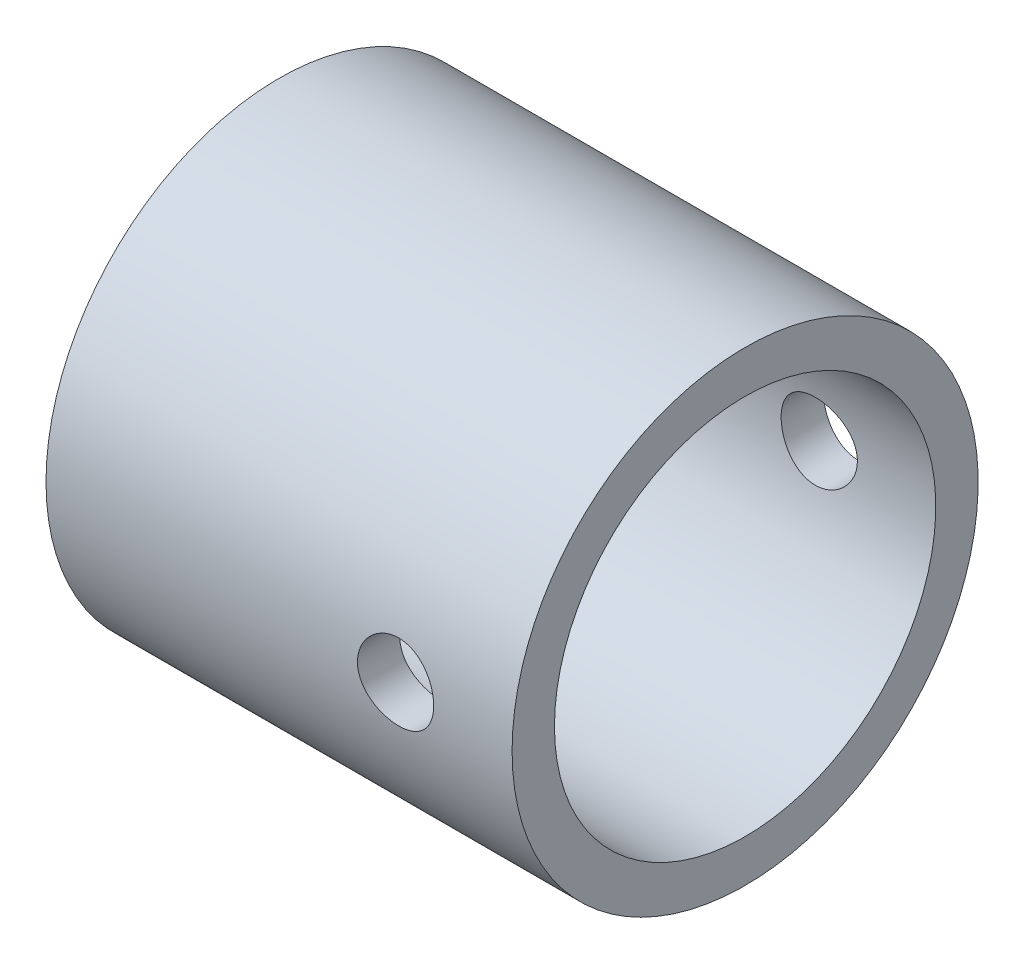
ISO-10303-21;
HEADER;
FILE_DESCRIPTION(('STEP AP214'),'2;1');
FILE_NAME('part.step','',(''),(''),'','','');
FILE_SCHEMA(('AUTOMOTIVE_DESIGN { 1 0 10303 214 1 1 1 1 }'));
ENDSEC;
DATA;
#1=APPLICATION_CONTEXT('core data for automotive mechanical design processes');
#2=APPLICATION_PROTOCOL_DEFINITION('international standard','automotive_design',2000,#1);
#3=PRODUCT_CONTEXT('',#1,'mechanical');
#4=PRODUCT('Part','Part','',(#3));
#5=PRODUCT_RELATED_PRODUCT_CATEGORY('part','',(#4));
#6=PRODUCT_DEFINITION_FORMATION('','',#4);
#7=PRODUCT_DEFINITION_CONTEXT('part definition',#1,'design');
#8=PRODUCT_DEFINITION('design','',#6,#7);
#9=PRODUCT_DEFINITION_SHAPE('','',#8);
#10=(LENGTH_UNIT() NAMED_UNIT(*) SI_UNIT(.MILLI.,.METRE.));
#11=(NAMED_UNIT(*) PLANE_ANGLE_UNIT() SI_UNIT($,.RADIAN.));
#12=(NAMED_UNIT(*) SI_UNIT($,.STERADIAN.) SOLID_ANGLE_UNIT());
#13=UNCERTAINTY_MEASURE_WITH_UNIT(LENGTH_MEASURE(1.E-05),#10,'distance_accuracy_value','');
#14=(GEOMETRIC_REPRESENTATION_CONTEXT(3) GLOBAL_UNCERTAINTY_ASSIGNED_CONTEXT((#13)) GLOBAL_UNIT_ASSIGNED_CONTEXT((#10,
#11,#12)) REPRESENTATION_CONTEXT('',''));
#15=CARTESIAN_POINT('',(0.,0.,0.));
#16=DIRECTION('',(0.,0.,1.));
#17=DIRECTION('',(1.,0.,0.));
#18=AXIS2_PLACEMENT_3D('',#15,#16,#17);
#19=CARTESIAN_POINT('',(261.558388757778,0.,0.));
#20=DIRECTION('',(-1.,0.,0.));
#21=DIRECTION('',(0.,0.,1.));
#22=AXIS2_PLACEMENT_3D('',#19,#20,#21);
#23=PLANE('',#22);
#24=CARTESIAN_POINT('',(261.558388757778,-148.573704322227,0.));
#25=DIRECTION('',(-1.,0.,0.));
#26=DIRECTION('',(0.,0.,1.));
#27=AXIS2_PLACEMENT_3D('',#24,#25,#26);
#28=CIRCLE('',#27,5.50000000000001);
#29=CARTESIAN_POINT('',(261.558388757778,-148.573704322227,5.50000000000001));
#30=VERTEX_POINT('',#29);
#31=EDGE_CURVE('E150',#30,#30,#28,.T.);
#32=ORIENTED_EDGE('',*,*,#31,.T.);
#33=EDGE_LOOP('',(#32));
#34=FACE_BOUND('',#33,.T.);
#35=CARTESIAN_POINT('',(261.558388757778,-148.573704322227,0.));
#36=DIRECTION('',(-1.,0.,0.));
#37=DIRECTION('',(0.,0.,1.));
#38=AXIS2_PLACEMENT_3D('',#35,#36,#37);
#39=CIRCLE('',#38,0.5);
#40=CARTESIAN_POINT('',(261.558388757778,-148.573704322227,0.5));
#41=VERTEX_POINT('',#40);
#42=EDGE_CURVE('E64',#41,#41,#39,.T.);
#43=ORIENTED_EDGE('',*,*,#42,.F.);
#44=EDGE_LOOP('',(#43));
#45=FACE_BOUND('',#44,.T.);
#46=ADVANCED_FACE('F47',(#34,#45),#23,.T.);
#47=CARTESIAN_POINT('',(263.058388757778,-148.573704322227,0.));
#48=DIRECTION('',(-1.,0.,0.));
#49=DIRECTION('',(0.,0.,1.));
#50=AXIS2_PLACEMENT_3D('',#47,#48,#49);
#51=CYLINDRICAL_SURFACE('',#50,0.5);
#52=ORIENTED_EDGE('',*,*,#42,.T.);
#53=EDGE_LOOP('',(#52));
#54=FACE_BOUND('',#53,.T.);
#55=CARTESIAN_POINT('',(263.058388757778,-148.573704322227,0.));
#56=DIRECTION('',(-1.,0.,0.));
#57=DIRECTION('',(0.,0.,1.));
#58=AXIS2_PLACEMENT_3D('',#55,#56,#57);
#59=CIRCLE('',#58,0.5);
#60=CARTESIAN_POINT('',(263.058388757778,-148.573704322227,0.5));
#61=VERTEX_POINT('',#60);
#62=EDGE_CURVE('E69',#61,#61,#59,.T.);
#63=ORIENTED_EDGE('',*,*,#62,.F.);
#64=EDGE_LOOP('',(#63));
#65=FACE_BOUND('',#64,.T.);
#66=ADVANCED_FACE('F116',(#54,#65),#51,.F.);
#67=CARTESIAN_POINT('',(263.058388757778,0.,0.));
#68=DIRECTION('',(-1.,0.,0.));
#69=DIRECTION('',(0.,0.,1.));
#70=AXIS2_PLACEMENT_3D('',#67,#68,#69);
#71=PLANE('',#70);
#72=CARTESIAN_POINT('',(263.058388757778,-148.573704322227,0.));
#73=DIRECTION('',(-1.,0.,0.));
#74=DIRECTION('',(0.,0.,1.));
#75=AXIS2_PLACEMENT_3D('',#72,#73,#74);
#76=CIRCLE('',#75,4.);
#77=CARTESIAN_POINT('',(263.058388757778,-148.573704322227,4.));
#78=VERTEX_POINT('',#77);
#79=EDGE_CURVE('E130',#78,#78,#76,.T.);
#80=ORIENTED_EDGE('',*,*,#79,.F.);
#81=EDGE_LOOP('',(#80));
#82=FACE_BOUND('',#81,.T.);
#83=ORIENTED_EDGE('',*,*,#62,.T.);
#84=EDGE_LOOP('',(#83));
#85=FACE_BOUND('',#84,.T.);
#86=ADVANCED_FACE('F113',(#82,#85),#71,.F.);
#87=CARTESIAN_POINT('',(263.058388757778,-148.573704322227,0.));
#88=DIRECTION('',(-1.,0.,0.));
#89=DIRECTION('',(0.,0.,1.));
#90=AXIS2_PLACEMENT_3D('',#87,#88,#89);
#91=CYLINDRICAL_SURFACE('',#90,4.);
#92=CARTESIAN_POINT('',(262.558388757778,-148.573704322227,0.));
#93=DIRECTION('',(-1.,0.,0.));
#94=DIRECTION('',(0.,0.,1.));
#95=AXIS2_PLACEMENT_3D('',#92,#93,#94);
#96=CIRCLE('',#95,4.);
#97=CARTESIAN_POINT('',(262.558388757778,-148.573704322227,4.));
#98=VERTEX_POINT('',#97);
#99=EDGE_CURVE('E133',#98,#98,#96,.T.);
#100=ORIENTED_EDGE('',*,*,#99,.F.);
#101=EDGE_LOOP('',(#100));
#102=FACE_BOUND('',#101,.T.);
#103=ORIENTED_EDGE('',*,*,#79,.T.);
#104=EDGE_LOOP('',(#103));
#105=FACE_BOUND('',#104,.T.);
#106=ADVANCED_FACE('F109',(#102,#105),#91,.T.);
#107=CARTESIAN_POINT('',(262.558388757778,0.,0.));
#108=DIRECTION('',(-1.,0.,0.));
#109=DIRECTION('',(0.,0.,1.));
#110=AXIS2_PLACEMENT_3D('',#107,#108,#109);
#111=PLANE('',#110);
#112=CARTESIAN_POINT('',(262.558388757778,-148.573704322227,0.));
#113=DIRECTION('',(-1.,0.,0.));
#114=DIRECTION('',(0.,0.,1.));
#115=AXIS2_PLACEMENT_3D('',#112,#113,#114);
#116=CIRCLE('',#115,4.5);
#117=CARTESIAN_POINT('',(262.558388757778,-148.573704322227,4.5));
#118=VERTEX_POINT('',#117);
#119=EDGE_CURVE('E139',#118,#118,#116,.T.);
#120=ORIENTED_EDGE('',*,*,#119,.F.);
#121=EDGE_LOOP('',(#120));
#122=FACE_BOUND('',#121,.T.);
#123=ORIENTED_EDGE('',*,*,#99,.T.);
#124=EDGE_LOOP('',(#123));
#125=FACE_BOUND('',#124,.T.);
#126=ADVANCED_FACE('F104',(#122,#125),#111,.F.);
#127=CARTESIAN_POINT('',(263.058388757778,-148.573704322227,0.));
#128=DIRECTION('',(-1.,0.,0.));
#129=DIRECTION('',(0.,0.,1.));
#130=AXIS2_PLACEMENT_3D('',#127,#128,#129);
#131=CYLINDRICAL_SURFACE('',#130,4.5);
#132=CARTESIAN_POINT('',(270.708388757778,-148.573704322227,4.5));
#133=CARTESIAN_POINT('',(270.708386917729,-148.523685106114,4.49999907822784));
#134=CARTESIAN_POINT('',(270.704204799107,-148.473642628046,4.49915746660408));
#135=CARTESIAN_POINT('',(270.687600107674,-148.374972165307,4.49588129060909));
#136=CARTESIAN_POINT('',(270.675170988256,-148.32634533644,4.49344546074168));
#137=CARTESIAN_POINT('',(270.642471611519,-148.23194704749,4.48725284350458));
#138=CARTESIAN_POINT('',(270.622208864617,-148.186172901087,4.48349732169046));
#139=CARTESIAN_POINT('',(270.574439735018,-148.098677132249,4.47507358231783));
#140=CARTESIAN_POINT('',(270.546933783731,-148.056955268659,4.47040541912137));
#141=CARTESIAN_POINT('',(270.485064112915,-147.978180192644,4.46059948796973));
#142=CARTESIAN_POINT('',(270.450621237926,-147.941189766184,4.45545670953913));
#143=CARTESIAN_POINT('',(270.376025583025,-147.87347124128,4.4453176240733));
#144=CARTESIAN_POINT('',(270.335872357576,-147.842743631934,4.44032132850382));
#145=CARTESIAN_POINT('',(270.250544184067,-147.788155744214,4.43099197631354));
#146=CARTESIAN_POINT('',(270.205326878361,-147.764360477248,4.42666536628451));
#147=CARTESIAN_POINT('',(270.111435120674,-147.724729222305,4.41923641252576));
#148=CARTESIAN_POINT('',(270.062761010766,-147.708892448034,4.41613394785766));
#149=CARTESIAN_POINT('',(269.964012830261,-147.685831552331,4.41155524726984));
#150=CARTESIAN_POINT('',(269.91396546805,-147.678497274064,4.41005823096469));
#151=CARTESIAN_POINT('',(269.81332991855,-147.672307407274,4.40879737554565));
#152=CARTESIAN_POINT('',(269.76274178709,-147.673450951785,4.40903335921057));
#153=CARTESIAN_POINT('',(269.663266648559,-147.684095206435,4.41119296033366));
#154=CARTESIAN_POINT('',(269.614365492713,-147.693469636008,4.41309107572887));
#155=CARTESIAN_POINT('',(269.518844288781,-147.720110226066,4.41832091544001));
#156=CARTESIAN_POINT('',(269.472224349751,-147.737376763436,4.42165270822001));
#157=CARTESIAN_POINT('',(269.382225022244,-147.77943201692,4.42940056650367));
#158=CARTESIAN_POINT('',(269.338869666165,-147.804270786118,4.43382380832334));
#159=CARTESIAN_POINT('',(269.256894992802,-147.860730105112,4.44325156895756));
#160=CARTESIAN_POINT('',(269.218276220612,-147.892351434306,4.4482561545453));
#161=CARTESIAN_POINT('',(269.146142295566,-147.962154381123,4.45839319117316));
#162=CARTESIAN_POINT('',(269.112731446705,-148.000443777136,4.46352632289815));
#163=CARTESIAN_POINT('',(269.052790296107,-148.082137800571,4.47325963842968));
#164=CARTESIAN_POINT('',(269.026260082613,-148.125542493586,4.47785981540077));
#165=CARTESIAN_POINT('',(268.980813999474,-148.216350874036,4.48602021144799));
#166=CARTESIAN_POINT('',(268.961910053498,-148.2637606846,4.48957879963445));
#167=CARTESIAN_POINT('',(268.932364331143,-148.361170243423,4.49524268089073));
#168=CARTESIAN_POINT('',(268.921721553911,-148.411169677162,4.49734815000479));
#169=CARTESIAN_POINT('',(268.909147949363,-148.511442857163,4.49984404680181));
#170=CARTESIAN_POINT('',(268.907074380191,-148.561698026734,4.50026257187223));
#171=CARTESIAN_POINT('',(268.911313630826,-148.661836763,4.49941546737093));
#172=CARTESIAN_POINT('',(268.917625979195,-148.711720350426,4.49814993247302));
#173=CARTESIAN_POINT('',(268.938339293967,-148.809239416179,4.49409448807216));
#174=CARTESIAN_POINT('',(268.952667019426,-148.856891075733,4.49131838763786));
#175=CARTESIAN_POINT('',(268.988924342168,-148.949115586977,4.4845519685493));
#176=CARTESIAN_POINT('',(269.010854508987,-148.993688207701,4.48056155892804));
#177=CARTESIAN_POINT('',(269.062002999364,-149.079091378545,4.47173920379965));
#178=CARTESIAN_POINT('',(269.091307260713,-149.119869436304,4.46689755393347));
#179=CARTESIAN_POINT('',(269.156257029864,-149.195980539434,4.45693261346894));
#180=CARTESIAN_POINT('',(269.191903217538,-149.231313000265,4.45180929271549));
#181=CARTESIAN_POINT('',(269.26917477448,-149.296080853924,4.44176373201269));
#182=CARTESIAN_POINT('',(269.310882927577,-149.325418254431,4.43684574209975));
#183=CARTESIAN_POINT('',(269.398718982999,-149.376671200273,4.42785772616576));
#184=CARTESIAN_POINT('',(269.444846708394,-149.398587042558,4.42378766622009));
#185=CARTESIAN_POINT('',(269.539980179312,-149.434240979651,4.41699066525945));
#186=CARTESIAN_POINT('',(269.588969514867,-149.448021472039,4.41425677384968));
#187=CARTESIAN_POINT('',(269.688628865919,-149.467142108692,4.41042693112823));
#188=CARTESIAN_POINT('',(269.739298661366,-149.47248335363,4.40933076622001));
#189=CARTESIAN_POINT('',(269.839896735868,-149.474533142008,4.40891234668241));
#190=CARTESIAN_POINT('',(269.889821791812,-149.471396531491,4.40955827270371));
#191=CARTESIAN_POINT('',(269.988417242692,-149.456921395917,4.41248016136153));
#192=CARTESIAN_POINT('',(270.037087647703,-149.445582936743,4.41475611090452));
#193=CARTESIAN_POINT('',(270.131693697894,-149.415095033876,4.42066737797243));
#194=CARTESIAN_POINT('',(270.17763568223,-149.395964578273,4.42429938916947));
#195=CARTESIAN_POINT('',(270.265682106439,-149.350453502369,4.43251543476753));
#196=CARTESIAN_POINT('',(270.30778622413,-149.324072274124,4.43709954899005));
#197=CARTESIAN_POINT('',(270.387732772713,-149.264279645535,4.44680064470903));
#198=CARTESIAN_POINT('',(270.425490646518,-149.230756420739,4.4519253561873));
#199=CARTESIAN_POINT('',(270.494896342754,-149.157862254339,4.4620747368476));
#200=CARTESIAN_POINT('',(270.526542759063,-149.118489970665,4.46709938276867));
#201=CARTESIAN_POINT('',(270.58313993733,-149.034520188406,4.47654449149175));
#202=CARTESIAN_POINT('',(270.60801716073,-148.989872318214,4.48095808097322));
#203=CARTESIAN_POINT('',(270.649876268115,-148.896954047074,4.48861612576501));
#204=CARTESIAN_POINT('',(270.666865268357,-148.848686957004,4.49186163424755));
#205=CARTESIAN_POINT('',(270.689175511018,-148.762543662258,4.49618735335834));
#206=CARTESIAN_POINT('',(270.696367632115,-148.725157819839,4.49760872842607));
#207=CARTESIAN_POINT('',(270.7059748789,-148.649753894916,4.49951538725904));
#208=CARTESIAN_POINT('',(270.708390156837,-148.611735832601,4.5000007008584));
#209=CARTESIAN_POINT('',(270.708388757778,-148.573704322227,4.5));
#210=B_SPLINE_CURVE_WITH_KNOTS('',3,(#132,#133,#134,#135,#136,#137,#138,#139,#140,#141,#142,
#143,#144,#145,#146,#147,#148,#149,#150,#151,#152,#153,#154,#155,#156,#157,#158,#159,#160,#161,
#162,#163,#164,#165,#166,#167,#168,#169,#170,#171,#172,#173,#174,#175,#176,#177,#178,#179,#180,
#181,#182,#183,#184,#185,#186,#187,#188,#189,#190,#191,#192,#193,#194,#195,#196,#197,#198,#199,
#200,#201,#202,#203,#204,#205,#206,#207,#208,#209),.UNSPECIFIED.,.T.,.F.,(4,2,2,2,2,2,2,2,2,2,2,
2,2,2,2,2,2,2,2,2,2,2,2,2,2,2,2,2,2,2,2,2,2,2,2,2,2,2,4),(0.,0.14991851759514,0.299956185622215,
0.449850361725319,0.599735612007774,0.751439403100961,0.903155037072656,1.05625075505336,
1.20933134428681,1.36040566593233,1.51146453853104,1.66024554305651,1.80903365328353,
1.95882741183234,2.10863839274704,2.26114427242218,2.41365210785844,2.56639747368626,
2.71912433128235,2.8692966210864,3.01946046892083,3.16827408555657,3.31709885294425,
3.46774559430027,3.61840849511345,3.77136565721294,3.9243166985112,4.07646342929455,
4.22859031497375,4.37795750310933,4.52732349143351,4.67632765127795,4.8253443082368,
4.9768926861523,5.12847589079648,5.28164547008082,5.43467659965773,5.54866897760914,
5.66265772233901),.UNSPECIFIED.);
#211=CARTESIAN_POINT('',(270.708388757778,-148.573704322227,4.5));
#212=VERTEX_POINT('',#211);
#213=EDGE_CURVE('E94',#212,#212,#210,.T.);
#214=ORIENTED_EDGE('',*,*,#213,.T.);
#215=EDGE_LOOP('',(#214));
#216=FACE_BOUND('',#215,.T.);
#217=CARTESIAN_POINT('',(270.708388757778,-148.573704322227,-4.5));
#218=CARTESIAN_POINT('',(270.708386917729,-148.62372353834,-4.49999907822784));
#219=CARTESIAN_POINT('',(270.704204799107,-148.673766016408,-4.49915746660408));
#220=CARTESIAN_POINT('',(270.687600107674,-148.772436479147,-4.49588129060909));
#221=CARTESIAN_POINT('',(270.675170988256,-148.821063308014,-4.49344546074168));
#222=CARTESIAN_POINT('',(270.642471611519,-148.915461596964,-4.48725284350458));
#223=CARTESIAN_POINT('',(270.622208864617,-148.961235743367,-4.48349732169046));
#224=CARTESIAN_POINT('',(270.574439735018,-149.048731512205,-4.47507358231783));
#225=CARTESIAN_POINT('',(270.546933783731,-149.090453375795,-4.47040541912137));
#226=CARTESIAN_POINT('',(270.485064112915,-149.16922845181,-4.46059948796973));
#227=CARTESIAN_POINT('',(270.450621237926,-149.20621887827,-4.45545670953913));
#228=CARTESIAN_POINT('',(270.376025583025,-149.273937403174,-4.4453176240733));
#229=CARTESIAN_POINT('',(270.335872357576,-149.30466501252,-4.44032132850382));
#230=CARTESIAN_POINT('',(270.250544184067,-149.35925290024,-4.43099197631354));
#231=CARTESIAN_POINT('',(270.205326878361,-149.383048167206,-4.42666536628451));
#232=CARTESIAN_POINT('',(270.111435120674,-149.422679422149,-4.41923641252576));
#233=CARTESIAN_POINT('',(270.062761010766,-149.438516196421,-4.41613394785766));
#234=CARTESIAN_POINT('',(269.964012830261,-149.461577092123,-4.41155524726984));
#235=CARTESIAN_POINT('',(269.91396546805,-149.46891137039,-4.41005823096469));
#236=CARTESIAN_POINT('',(269.81332991855,-149.475101237181,-4.40879737554565));
#237=CARTESIAN_POINT('',(269.76274178709,-149.473957692669,-4.40903335921057));
#238=CARTESIAN_POINT('',(269.663266648559,-149.463313438019,-4.41119296033366));
#239=CARTESIAN_POINT('',(269.614365492713,-149.453939008447,-4.41309107572887));
#240=CARTESIAN_POINT('',(269.518844288781,-149.427298418388,-4.41832091544001));
#241=CARTESIAN_POINT('',(269.472224349751,-149.410031881018,-4.42165270822001));
#242=CARTESIAN_POINT('',(269.382225022245,-149.367976627534,-4.42940056650367));
#243=CARTESIAN_POINT('',(269.338869666165,-149.343137858336,-4.43382380832334));
#244=CARTESIAN_POINT('',(269.256894992802,-149.286678539342,-4.44325156895756));
#245=CARTESIAN_POINT('',(269.218276220612,-149.255057210148,-4.44825615454529));
#246=CARTESIAN_POINT('',(269.146142295566,-149.185254263332,-4.45839319117316));
#247=CARTESIAN_POINT('',(269.112731446704,-149.146964867318,-4.46352632289815));
#248=CARTESIAN_POINT('',(269.052790296107,-149.065270843883,-4.47325963842968));
#249=CARTESIAN_POINT('',(269.026260082613,-149.021866150868,-4.47785981540077));
#250=CARTESIAN_POINT('',(268.980813999474,-148.931057770418,-4.48602021144799));
#251=CARTESIAN_POINT('',(268.961910053498,-148.883647959854,-4.48957879963445));
#252=CARTESIAN_POINT('',(268.932364331143,-148.786238401031,-4.49524268089073));
#253=CARTESIAN_POINT('',(268.921721553911,-148.736238967292,-4.49734815000479));
#254=CARTESIAN_POINT('',(268.909147949363,-148.635965787291,-4.49984404680181));
#255=CARTESIAN_POINT('',(268.907074380191,-148.58571061772,-4.50026257187223));
#256=CARTESIAN_POINT('',(268.911313630826,-148.485571881454,-4.49941546737093));
#257=CARTESIAN_POINT('',(268.917625979195,-148.435688294028,-4.49814993247302));
#258=CARTESIAN_POINT('',(268.938339293967,-148.338169228275,-4.49409448807216));
#259=CARTESIAN_POINT('',(268.952667019426,-148.290517568721,-4.49131838763786));
#260=CARTESIAN_POINT('',(268.988924342168,-148.198293057477,-4.4845519685493));
#261=CARTESIAN_POINT('',(269.010854508987,-148.153720436753,-4.48056155892804));
#262=CARTESIAN_POINT('',(269.062002999364,-148.068317265909,-4.47173920379965));
#263=CARTESIAN_POINT('',(269.091307260713,-148.02753920815,-4.46689755393346));
#264=CARTESIAN_POINT('',(269.156257029864,-147.95142810502,-4.45693261346894));
#265=CARTESIAN_POINT('',(269.191903217538,-147.916095644189,-4.45180929271549));
#266=CARTESIAN_POINT('',(269.26917477448,-147.85132779053,-4.44176373201269));
#267=CARTESIAN_POINT('',(269.310882927577,-147.821990390023,-4.43684574209974));
#268=CARTESIAN_POINT('',(269.398718982999,-147.770737444181,-4.42785772616576));
#269=CARTESIAN_POINT('',(269.444846708394,-147.748821601896,-4.42378766622009));
#270=CARTESIAN_POINT('',(269.539980179312,-147.713167664803,-4.41699066525945));
#271=CARTESIAN_POINT('',(269.588969514867,-147.699387172415,-4.41425677384968));
#272=CARTESIAN_POINT('',(269.688628865919,-147.680266535763,-4.41042693112823));
#273=CARTESIAN_POINT('',(269.739298661366,-147.674925290824,-4.40933076622001));
#274=CARTESIAN_POINT('',(269.839896735868,-147.672875502446,-4.40891234668241));
#275=CARTESIAN_POINT('',(269.889821791812,-147.676012112963,-4.40955827270371));
#276=CARTESIAN_POINT('',(269.988417242692,-147.690487248537,-4.41248016136153));
#277=CARTESIAN_POINT('',(270.037087647703,-147.701825707711,-4.41475611090452));
#278=CARTESIAN_POINT('',(270.131693697894,-147.732313610578,-4.42066737797243));
#279=CARTESIAN_POINT('',(270.17763568223,-147.751444066181,-4.42429938916947));
#280=CARTESIAN_POINT('',(270.265682106439,-147.796955142086,-4.43251543476753));
#281=CARTESIAN_POINT('',(270.30778622413,-147.82333637033,-4.43709954899005));
#282=CARTESIAN_POINT('',(270.387732772713,-147.883128998919,-4.44680064470903));
#283=CARTESIAN_POINT('',(270.425490646518,-147.916652223715,-4.4519253561873));
#284=CARTESIAN_POINT('',(270.494896342754,-147.989546390115,-4.4620747368476));
#285=CARTESIAN_POINT('',(270.526542759063,-148.028918673789,-4.46709938276867));
#286=CARTESIAN_POINT('',(270.58313993733,-148.112888456048,-4.47654449149175));
#287=CARTESIAN_POINT('',(270.60801716073,-148.15753632624,-4.48095808097322));
#288=CARTESIAN_POINT('',(270.649876268115,-148.25045459738,-4.48861612576501));
#289=CARTESIAN_POINT('',(270.666865268357,-148.29872168745,-4.49186163424755));
#290=CARTESIAN_POINT('',(270.689175511018,-148.384864982196,-4.49618735335834));
#291=CARTESIAN_POINT('',(270.696367632115,-148.422250824615,-4.49760872842607));
#292=CARTESIAN_POINT('',(270.7059748789,-148.497654749538,-4.49951538725904));
#293=CARTESIAN_POINT('',(270.708390156837,-148.535672811853,-4.5000007008584));
#294=CARTESIAN_POINT('',(270.708388757778,-148.573704322227,-4.5));
#295=B_SPLINE_CURVE_WITH_KNOTS('',3,(#217,#218,#219,#220,#221,#222,#223,#224,#225,#226,#227,
#228,#229,#230,#231,#232,#233,#234,#235,#236,#237,#238,#239,#240,#241,#242,#243,#244,#245,#246,
#247,#248,#249,#250,#251,#252,#253,#254,#255,#256,#257,#258,#259,#260,#261,#262,#263,#264,#265,
#266,#267,#268,#269,#270,#271,#272,#273,#274,#275,#276,#277,#278,#279,#280,#281,#282,#283,#284,
#285,#286,#287,#288,#289,#290,#291,#292,#293,#294),.UNSPECIFIED.,.T.,.F.,(4,2,2,2,2,2,2,2,2,2,2,
2,2,2,2,2,2,2,2,2,2,2,2,2,2,2,2,2,2,2,2,2,2,2,2,2,2,2,4),(0.,0.14991851759514,0.299956185622215,
0.449850361725319,0.599735612007774,0.751439403100961,0.903155037072656,1.05625075505336,
1.20933134428681,1.36040566593233,1.51146453853104,1.66024554305651,1.80903365328353,
1.95882741183228,2.10863839274704,2.26114427242218,2.41365210785844,2.56639747368624,
2.71912433128235,2.8692966210864,3.01946046892083,3.16827408555657,3.31709885294425,
3.4677455943003,3.61840849511344,3.77136565721299,3.92431669851119,4.07646342929454,
4.22859031497374,4.37795750310932,4.5273234914335,4.67632765127794,4.82534430823679,
4.97689268615229,5.12847589079647,5.28164547008082,5.43467659965772,5.54866897760913,
5.662657722339),.UNSPECIFIED.);
#296=CARTESIAN_POINT('',(270.708388757778,-148.573704322227,-4.5));
#297=VERTEX_POINT('',#296);
#298=EDGE_CURVE('E87',#297,#297,#295,.T.);
#299=ORIENTED_EDGE('',*,*,#298,.T.);
#300=EDGE_LOOP('',(#299));
#301=FACE_BOUND('',#300,.T.);
#302=CARTESIAN_POINT('',(272.558388757778,-148.573704322227,0.));
#303=DIRECTION('',(-1.,0.,0.));
#304=DIRECTION('',(0.,0.,1.));
#305=AXIS2_PLACEMENT_3D('',#302,#303,#304);
#306=CIRCLE('',#305,4.5);
#307=CARTESIAN_POINT('',(272.558388757778,-148.573704322227,4.5));
#308=VERTEX_POINT('',#307);
#309=EDGE_CURVE('E143',#308,#308,#306,.T.);
#310=ORIENTED_EDGE('',*,*,#309,.F.);
#311=EDGE_LOOP('',(#310));
#312=FACE_BOUND('',#311,.T.);
#313=ORIENTED_EDGE('',*,*,#119,.T.);
#314=EDGE_LOOP('',(#313));
#315=FACE_BOUND('',#314,.T.);
#316=ADVANCED_FACE('F99',(#216,#301,#312,#315),#131,.F.);
#317=CARTESIAN_POINT('',(272.558388757778,0.,0.));
#318=DIRECTION('',(-1.,0.,0.));
#319=DIRECTION('',(0.,0.,1.));
#320=AXIS2_PLACEMENT_3D('',#317,#318,#319);
#321=PLANE('',#320);
#322=CARTESIAN_POINT('',(272.558388757778,-148.573704322227,0.));
#323=DIRECTION('',(-1.,0.,0.));
#324=DIRECTION('',(0.,0.,1.));
#325=AXIS2_PLACEMENT_3D('',#322,#323,#324);
#326=CIRCLE('',#325,5.50000000000001);
#327=CARTESIAN_POINT('',(272.558388757778,-148.573704322227,5.50000000000001));
#328=VERTEX_POINT('',#327);
#329=EDGE_CURVE('E147',#328,#328,#326,.T.);
#330=ORIENTED_EDGE('',*,*,#329,.F.);
#331=EDGE_LOOP('',(#330));
#332=FACE_BOUND('',#331,.T.);
#333=ORIENTED_EDGE('',*,*,#309,.T.);
#334=EDGE_LOOP('',(#333));
#335=FACE_BOUND('',#334,.T.);
#336=ADVANCED_FACE('F103',(#332,#335),#321,.F.);
#337=CARTESIAN_POINT('',(263.058388757778,-148.573704322227,0.));
#338=DIRECTION('',(-1.,0.,0.));
#339=DIRECTION('',(0.,0.,1.));
#340=AXIS2_PLACEMENT_3D('',#337,#338,#339);
#341=CYLINDRICAL_SURFACE('',#340,5.50000000000001);
#342=CARTESIAN_POINT('',(270.708388757778,-148.573704322227,-5.50000000000001));
#343=CARTESIAN_POINT('',(270.708386733695,-148.623898340013,-5.49999914910707));
#344=CARTESIAN_POINT('',(270.70417550897,-148.67412008011,-5.49930571462299));
#345=CARTESIAN_POINT('',(270.687448362001,-148.773155903878,-5.49660623439495));
#346=CARTESIAN_POINT('',(270.674924717895,-148.821968634605,-5.49459896818477));
#347=CARTESIAN_POINT('',(270.641960230735,-148.916739188551,-5.48949704749197));
#348=CARTESIAN_POINT('',(270.621525771265,-148.962699279081,-5.48640326994939));
#349=CARTESIAN_POINT('',(270.573336220555,-149.05053231821,-5.47946881638054));
#350=CARTESIAN_POINT('',(270.545582000355,-149.092405752303,-5.47562822923767));
#351=CARTESIAN_POINT('',(270.483268184614,-149.171269412535,-5.46758652705941));
#352=CARTESIAN_POINT('',(270.448654271272,-149.208216447327,-5.46338269614423));
#353=CARTESIAN_POINT('',(270.373720543459,-149.275805511533,-5.45510918002664));
#354=CARTESIAN_POINT('',(270.333400375314,-149.306447149848,-5.45103950315839));
#355=CARTESIAN_POINT('',(270.247903199426,-149.360727781459,-5.44346876901574));
#356=CARTESIAN_POINT('',(270.202698847617,-149.384324237393,-5.43997122125196));
#357=CARTESIAN_POINT('',(270.108901394841,-149.423572702183,-5.43397831997116));
#358=CARTESIAN_POINT('',(270.060308514556,-149.439225227852,-5.43148290126037));
#359=CARTESIAN_POINT('',(269.961570557069,-149.46200579468,-5.42780377201874));
#360=CARTESIAN_POINT('',(269.911443091911,-149.469208287969,-5.42660861198802));
#361=CARTESIAN_POINT('',(269.810677954334,-149.475115140382,-5.42563066229594));
#362=CARTESIAN_POINT('',(269.760040316962,-149.473820079313,-5.42584777627198));
#363=CARTESIAN_POINT('',(269.660222677858,-149.462829266386,-5.42765938679131));
#364=CARTESIAN_POINT('',(269.611033197397,-149.453217014999,-5.42924019207434));
#365=CARTESIAN_POINT('',(269.514974706532,-149.425995656567,-5.43357964514088));
#366=CARTESIAN_POINT('',(269.468105773149,-149.408386284285,-5.43633833199051));
#367=CARTESIAN_POINT('',(269.37776806748,-149.365585478846,-5.44273756667078));
#368=CARTESIAN_POINT('',(269.334316082764,-149.340359240656,-5.44638214733467));
#369=CARTESIAN_POINT('',(269.252230169098,-149.283065509188,-5.45413969603974));
#370=CARTESIAN_POINT('',(269.213596615674,-149.25099748322,-5.45825270054002));
#371=CARTESIAN_POINT('',(269.141760775547,-149.180474875011,-5.46654388732993));
#372=CARTESIAN_POINT('',(269.108628831125,-149.141948622099,-5.47072226155448));
#373=CARTESIAN_POINT('',(269.049289417013,-149.059845927928,-5.47862796405286));
#374=CARTESIAN_POINT('',(269.023081989008,-149.016269456269,-5.48235528961136));
#375=CARTESIAN_POINT('',(268.97832966841,-148.925238140156,-5.4889439430125));
#376=CARTESIAN_POINT('',(268.959790840756,-148.877780261367,-5.49180458493635));
#377=CARTESIAN_POINT('',(268.930966466986,-148.780367301027,-5.49633200679106));
#378=CARTESIAN_POINT('',(268.920680255615,-148.730412421106,-5.49799888295189));
#379=CARTESIAN_POINT('',(268.908748114711,-148.630029933561,-5.49993805863441));
#380=CARTESIAN_POINT('',(268.907005593167,-148.579614098038,-5.50022594764692));
#381=CARTESIAN_POINT('',(268.911952992186,-148.479210720478,-5.49941736046967));
#382=CARTESIAN_POINT('',(268.918642600376,-148.429223162645,-5.49832093556263));
#383=CARTESIAN_POINT('',(268.940184028283,-148.331392564769,-5.49487656564154));
#384=CARTESIAN_POINT('',(268.954988171218,-148.283538747053,-5.49253593334565));
#385=CARTESIAN_POINT('',(268.992287712025,-148.190992271272,-5.48686458311915));
#386=CARTESIAN_POINT('',(269.014783528793,-148.146299785537,-5.48353381126566));
#387=CARTESIAN_POINT('',(269.06705008745,-148.060924085645,-5.47621311854356));
#388=CARTESIAN_POINT('',(269.096881343383,-148.020278388752,-5.47221780911506));
#389=CARTESIAN_POINT('',(269.162888547242,-147.944535521261,-5.46402787646821));
#390=CARTESIAN_POINT('',(269.199064938412,-147.909438738612,-5.45983323934067));
#391=CARTESIAN_POINT('',(269.277168115973,-147.845433164168,-5.45166718823532));
#392=CARTESIAN_POINT('',(269.319148626163,-147.816589539302,-5.4476984160306));
#393=CARTESIAN_POINT('',(269.407415727165,-147.766363760372,-5.44048230788445));
#394=CARTESIAN_POINT('',(269.45370218504,-147.744981376057,-5.43723494968159));
#395=CARTESIAN_POINT('',(269.54908277881,-147.710383181936,-5.43184904103185));
#396=CARTESIAN_POINT('',(269.59816475909,-147.697134584682,-5.42970604457279));
#397=CARTESIAN_POINT('',(269.697895314698,-147.679076633559,-5.42676021676874));
#398=CARTESIAN_POINT('',(269.748543758845,-147.674266574952,-5.42595727351063));
#399=CARTESIAN_POINT('',(269.849319017764,-147.673241350847,-5.42578716739648));
#400=CARTESIAN_POINT('',(269.89944478995,-147.676923632283,-5.42640287292539));
#401=CARTESIAN_POINT('',(269.99835343685,-147.692557184656,-5.42896320313355));
#402=CARTESIAN_POINT('',(270.047136315472,-147.704508431532,-5.43090782394612));
#403=CARTESIAN_POINT('',(270.141936870729,-147.736301939271,-5.43590046262708));
#404=CARTESIAN_POINT('',(270.18795747031,-147.756135683456,-5.43894728929453));
#405=CARTESIAN_POINT('',(270.27603456176,-147.803120712931,-5.44580224572264));
#406=CARTESIAN_POINT('',(270.318090868553,-147.830272339633,-5.4496104110011));
#407=CARTESIAN_POINT('',(270.397564240096,-147.89148965821,-5.4576134200958));
#408=CARTESIAN_POINT('',(270.434922724665,-147.925630897143,-5.46181218929682));
#409=CARTESIAN_POINT('',(270.503415704621,-147.999698882699,-5.47009172755808));
#410=CARTESIAN_POINT('',(270.534548760047,-148.039626964159,-5.47417246913191));
#411=CARTESIAN_POINT('',(270.589895153849,-148.124449512786,-5.48178745715275));
#412=CARTESIAN_POINT('',(270.614061218599,-148.169375168547,-5.48531789871692));
#413=CARTESIAN_POINT('',(270.654466763874,-148.262687124138,-5.49139743946163));
#414=CARTESIAN_POINT('',(270.670714198792,-148.311069894973,-5.49394752288154));
#415=CARTESIAN_POINT('',(270.691264435035,-148.395322665871,-5.49721766349432));
#416=CARTESIAN_POINT('',(270.697675861527,-148.430680924402,-5.4982555043514));
#417=CARTESIAN_POINT('',(270.706238712095,-148.501922841882,-5.49964697131891));
#418=CARTESIAN_POINT('',(270.708390205364,-148.537806492288,-5.50000060854284));
#419=CARTESIAN_POINT('',(270.708388757778,-148.573704322227,-5.50000000000001));
#420=B_SPLINE_CURVE_WITH_KNOTS('',3,(#342,#343,#344,#345,#346,#347,#348,#349,#350,#351,#352,
#353,#354,#355,#356,#357,#358,#359,#360,#361,#362,#363,#364,#365,#366,#367,#368,#369,#370,#371,
#372,#373,#374,#375,#376,#377,#378,#379,#380,#381,#382,#383,#384,#385,#386,#387,#388,#389,#390,
#391,#392,#393,#394,#395,#396,#397,#398,#399,#400,#401,#402,#403,#404,#405,#406,#407,#408,#409,
#410,#411,#412,#413,#414,#415,#416,#417,#418,#419),.UNSPECIFIED.,.T.,.F.,(4,2,2,2,2,2,2,2,2,2,2,
2,2,2,2,2,2,2,2,2,2,2,2,2,2,2,2,2,2,2,2,2,2,2,2,2,2,2,4),(0.,0.150450844495654,
0.301041646999893,0.451511183628285,0.601962822699474,0.753657168731779,0.905360920912166,
1.05796292042998,1.21055499077575,1.3617922474943,1.51301918506776,1.66274526628237,
1.81247631375995,1.96290218179831,2.11333976603558,2.26557322505333,2.41780760048171,
2.57016214579651,2.7225044083609,2.87312030606753,3.02373062428489,3.17346537532817,
3.32320828240182,3.47423057716736,3.62526342586865,3.77780172141723,3.93033530927656,
4.08224992348556,4.23415185007169,4.38422903676843,4.53430578679502,4.68422082466682,
4.83414285797473,4.98578008473734,5.13745234517284,5.2901307592125,5.44265548758255,
5.55025688703605,5.65785653870987),.UNSPECIFIED.);
#421=CARTESIAN_POINT('',(270.708388757778,-148.573704322227,-5.50000000000001));
#422=VERTEX_POINT('',#421);
#423=EDGE_CURVE('E10',#422,#422,#420,.T.);
#424=ORIENTED_EDGE('',*,*,#423,.F.);
#425=EDGE_LOOP('',(#424));
#426=FACE_BOUND('',#425,.T.);
#427=CARTESIAN_POINT('',(270.708388757778,-148.573704322227,5.50000000000001));
#428=CARTESIAN_POINT('',(270.708386733695,-148.523510304441,5.49999914910707));
#429=CARTESIAN_POINT('',(270.70417550897,-148.473288564344,5.49930571462299));
#430=CARTESIAN_POINT('',(270.687448362001,-148.374252740576,5.49660623439495));
#431=CARTESIAN_POINT('',(270.674924717895,-148.325440009849,5.49459896818477));
#432=CARTESIAN_POINT('',(270.641960230735,-148.230669455903,5.48949704749197));
#433=CARTESIAN_POINT('',(270.621525771265,-148.184709365373,5.48640326994939));
#434=CARTESIAN_POINT('',(270.573336220555,-148.096876326244,5.47946881638054));
#435=CARTESIAN_POINT('',(270.545582000355,-148.055002892152,5.47562822923767));
#436=CARTESIAN_POINT('',(270.483268184614,-147.976139231919,5.46758652705941));
#437=CARTESIAN_POINT('',(270.448654271272,-147.939192197127,5.46338269614423));
#438=CARTESIAN_POINT('',(270.373720543459,-147.871603132921,5.45510918002664));
#439=CARTESIAN_POINT('',(270.333400375314,-147.840961494606,5.45103950315839));
#440=CARTESIAN_POINT('',(270.247903199426,-147.786680862996,5.44346876901574));
#441=CARTESIAN_POINT('',(270.202698847617,-147.763084407061,5.43997122125196));
#442=CARTESIAN_POINT('',(270.108901394841,-147.723835942271,5.43397831997116));
#443=CARTESIAN_POINT('',(270.060308514556,-147.708183416602,5.43148290126037));
#444=CARTESIAN_POINT('',(269.961570557069,-147.685402849774,5.42780377201874));
#445=CARTESIAN_POINT('',(269.911443091911,-147.678200356485,5.42660861198802));
#446=CARTESIAN_POINT('',(269.810677954334,-147.672293504072,5.42563066229594));
#447=CARTESIAN_POINT('',(269.760040316962,-147.673588565141,5.42584777627198));
#448=CARTESIAN_POINT('',(269.660222677858,-147.684579378068,5.42765938679131));
#449=CARTESIAN_POINT('',(269.611033197397,-147.694191629455,5.42924019207434));
#450=CARTESIAN_POINT('',(269.514974706532,-147.721412987887,5.43357964514088));
#451=CARTESIAN_POINT('',(269.468105773149,-147.739022360169,5.43633833199051));
#452=CARTESIAN_POINT('',(269.37776806748,-147.781823165608,5.44273756667078));
#453=CARTESIAN_POINT('',(269.334316082764,-147.807049403798,5.44638214733467));
#454=CARTESIAN_POINT('',(269.252230169098,-147.864343135266,5.45413969603974));
#455=CARTESIAN_POINT('',(269.213596615674,-147.896411161234,5.45825270054002));
#456=CARTESIAN_POINT('',(269.141760775547,-147.966933769443,5.46654388732993));
#457=CARTESIAN_POINT('',(269.108628831125,-148.005460022355,5.47072226155448));
#458=CARTESIAN_POINT('',(269.049289417013,-148.087562716526,5.47862796405286));
#459=CARTESIAN_POINT('',(269.023081989008,-148.131139188185,5.48235528961136));
#460=CARTESIAN_POINT('',(268.97832966841,-148.222170504298,5.4889439430125));
#461=CARTESIAN_POINT('',(268.959790840756,-148.269628383087,5.49180458493635));
#462=CARTESIAN_POINT('',(268.930966466986,-148.367041343428,5.49633200679106));
#463=CARTESIAN_POINT('',(268.920680255615,-148.416996223348,5.49799888295189));
#464=CARTESIAN_POINT('',(268.908748114711,-148.517378710894,5.49993805863441));
#465=CARTESIAN_POINT('',(268.907005593167,-148.567794546416,5.50022594764692));
#466=CARTESIAN_POINT('',(268.911952992186,-148.668197923976,5.49941736046967));
#467=CARTESIAN_POINT('',(268.918642600376,-148.718185481809,5.49832093556263));
#468=CARTESIAN_POINT('',(268.940184028283,-148.816016079685,5.49487656564154));
#469=CARTESIAN_POINT('',(268.954988171218,-148.863869897401,5.49253593334565));
#470=CARTESIAN_POINT('',(268.992287712025,-148.956416373182,5.48686458311915));
#471=CARTESIAN_POINT('',(269.014783528793,-149.001108858917,5.48353381126566));
#472=CARTESIAN_POINT('',(269.06705008745,-149.086484558809,5.47621311854356));
#473=CARTESIAN_POINT('',(269.096881343383,-149.127130255702,5.47221780911506));
#474=CARTESIAN_POINT('',(269.162888547242,-149.202873123193,5.46402787646822));
#475=CARTESIAN_POINT('',(269.199064938412,-149.237969905842,5.45983323934068));
#476=CARTESIAN_POINT('',(269.277168115973,-149.301975480287,5.45166718823533));
#477=CARTESIAN_POINT('',(269.319148626163,-149.330819105153,5.4476984160306));
#478=CARTESIAN_POINT('',(269.407415727165,-149.381044884082,5.44048230788445));
#479=CARTESIAN_POINT('',(269.45370218504,-149.402427268397,5.43723494968159));
#480=CARTESIAN_POINT('',(269.54908277881,-149.437025462518,5.43184904103185));
#481=CARTESIAN_POINT('',(269.59816475909,-149.450274059772,5.42970604457279));
#482=CARTESIAN_POINT('',(269.697895314698,-149.468332010895,5.42676021676874));
#483=CARTESIAN_POINT('',(269.748543758845,-149.473142069502,5.42595727351063));
#484=CARTESIAN_POINT('',(269.849319017764,-149.474167293607,5.42578716739648));
#485=CARTESIAN_POINT('',(269.89944478995,-149.470485012171,5.42640287292539));
#486=CARTESIAN_POINT('',(269.99835343685,-149.454851459799,5.42896320313355));
#487=CARTESIAN_POINT('',(270.047136315472,-149.442900212922,5.43090782394612));
#488=CARTESIAN_POINT('',(270.141936870729,-149.411106705183,5.43590046262708));
#489=CARTESIAN_POINT('',(270.18795747031,-149.391272960998,5.43894728929453));
#490=CARTESIAN_POINT('',(270.27603456176,-149.344287931523,5.44580224572264));
#491=CARTESIAN_POINT('',(270.318090868553,-149.317136304821,5.4496104110011));
#492=CARTESIAN_POINT('',(270.397564240096,-149.255918986244,5.4576134200958));
#493=CARTESIAN_POINT('',(270.434922724665,-149.221777747311,5.46181218929682));
#494=CARTESIAN_POINT('',(270.503415704621,-149.147709761756,5.47009172755808));
#495=CARTESIAN_POINT('',(270.534548760047,-149.107781680295,5.47417246913191));
#496=CARTESIAN_POINT('',(270.589895153849,-149.022959131668,5.48178745715275));
#497=CARTESIAN_POINT('',(270.614061218599,-148.978033475907,5.48531789871692));
#498=CARTESIAN_POINT('',(270.654466763874,-148.884721520316,5.49139743946163));
#499=CARTESIAN_POINT('',(270.670714198792,-148.836338749481,5.49394752288154));
#500=CARTESIAN_POINT('',(270.691264435035,-148.752085978583,5.49721766349432));
#501=CARTESIAN_POINT('',(270.697675861527,-148.716727720053,5.4982555043514));
#502=CARTESIAN_POINT('',(270.706238712095,-148.645485802572,5.49964697131891));
#503=CARTESIAN_POINT('',(270.708390205364,-148.609602152166,5.50000060854284));
#504=CARTESIAN_POINT('',(270.708388757778,-148.573704322227,5.50000000000001));
#505=B_SPLINE_CURVE_WITH_KNOTS('',3,(#427,#428,#429,#430,#431,#432,#433,#434,#435,#436,#437,
#438,#439,#440,#441,#442,#443,#444,#445,#446,#447,#448,#449,#450,#451,#452,#453,#454,#455,#456,
#457,#458,#459,#460,#461,#462,#463,#464,#465,#466,#467,#468,#469,#470,#471,#472,#473,#474,#475,
#476,#477,#478,#479,#480,#481,#482,#483,#484,#485,#486,#487,#488,#489,#490,#491,#492,#493,#494,
#495,#496,#497,#498,#499,#500,#501,#502,#503,#504),.UNSPECIFIED.,.T.,.F.,(4,2,2,2,2,2,2,2,2,2,2,
2,2,2,2,2,2,2,2,2,2,2,2,2,2,2,2,2,2,2,2,2,2,2,2,2,2,2,4),(0.,0.150450844495654,
0.301041646999893,0.451511183628285,0.601962822699474,0.753657168731779,0.905360920912166,
1.05796292042998,1.21055499077575,1.3617922474943,1.51301918506776,1.66274526628237,
1.81247631375995,1.96290218179831,2.11333976603558,2.26557322505333,2.41780760048171,
2.57016214579651,2.7225044083609,2.87312030606747,3.02373062428489,3.17346537532817,
3.32320828240182,3.47423057716726,3.62526342586865,3.77780172141723,3.93033530927655,
4.08224992348556,4.23415185007169,4.38422903676843,4.53430578679502,4.68422082466682,
4.83414285797473,4.98578008473734,5.13745234517283,5.2901307592125,5.44265548758255,
5.55025688703605,5.65785653870986),.UNSPECIFIED.);
#506=CARTESIAN_POINT('',(270.708388757778,-148.573704322227,5.50000000000001));
#507=VERTEX_POINT('',#506);
#508=EDGE_CURVE('E59',#507,#507,#505,.T.);
#509=ORIENTED_EDGE('',*,*,#508,.F.);
#510=EDGE_LOOP('',(#509));
#511=FACE_BOUND('',#510,.T.);
#512=ORIENTED_EDGE('',*,*,#329,.T.);
#513=EDGE_LOOP('',(#512));
#514=FACE_BOUND('',#513,.T.);
#515=ORIENTED_EDGE('',*,*,#31,.F.);
#516=EDGE_LOOP('',(#515));
#517=FACE_BOUND('',#516,.T.);
#518=ADVANCED_FACE('F75',(#426,#511,#514,#517),#341,.T.);
#519=CARTESIAN_POINT('',(269.808388757778,-148.573704322227,-5.50000000000001));
#520=DIRECTION('',(0.,0.,1.));
#521=DIRECTION('',(1.,0.,0.));
#522=AXIS2_PLACEMENT_3D('',#519,#520,#521);
#523=CYLINDRICAL_SURFACE('',#522,0.900000000000007);
#524=ORIENTED_EDGE('',*,*,#508,.T.);
#525=EDGE_LOOP('',(#524));
#526=FACE_BOUND('',#525,.T.);
#527=ORIENTED_EDGE('',*,*,#213,.F.);
#528=EDGE_LOOP('',(#527));
#529=FACE_BOUND('',#528,.T.);
#530=ADVANCED_FACE('F78',(#526,#529),#523,.F.);
#531=ORIENTED_EDGE('',*,*,#423,.T.);
#532=EDGE_LOOP('',(#531));
#533=FACE_BOUND('',#532,.T.);
#534=ORIENTED_EDGE('',*,*,#298,.F.);
#535=EDGE_LOOP('',(#534));
#536=FACE_BOUND('',#535,.T.);
#537=ADVANCED_FACE('F81',(#533,#536),#523,.F.);
#538=CLOSED_SHELL('',(#46,#66,#86,#106,#126,#316,#336,#518,#530,#537));
#539=MANIFOLD_SOLID_BREP('B2',#538);
#540=ADVANCED_BREP_SHAPE_REPRESENTATION('',(#18,#539),#14);
#541=SHAPE_DEFINITION_REPRESENTATION(#9,#540);
ENDSEC;
END-ISO-10303-21;
